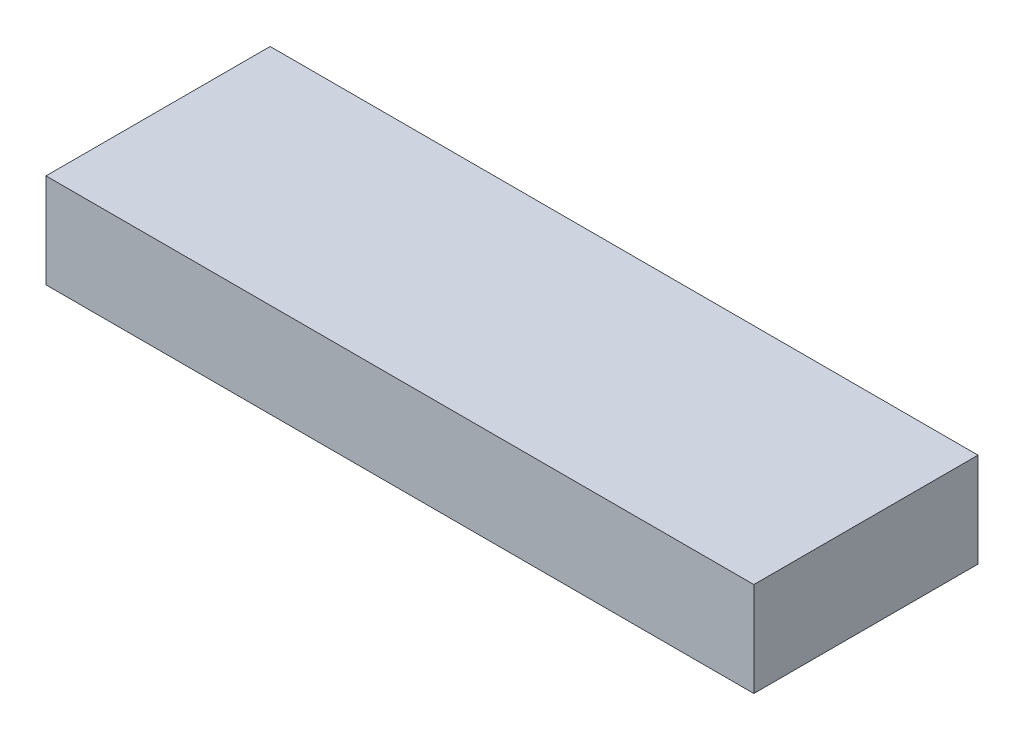
ISO-10303-21;
HEADER;
FILE_DESCRIPTION(('STEP AP214'),'2;1');
FILE_NAME('part.step','',(''),(''),'','','');
FILE_SCHEMA(('AUTOMOTIVE_DESIGN { 1 0 10303 214 1 1 1 1 }'));
ENDSEC;
DATA;
#1=APPLICATION_CONTEXT('core data for automotive mechanical design processes');
#2=APPLICATION_PROTOCOL_DEFINITION('international standard','automotive_design',2000,#1);
#3=PRODUCT_CONTEXT('',#1,'mechanical');
#4=PRODUCT('Part','Part','',(#3));
#5=PRODUCT_RELATED_PRODUCT_CATEGORY('part','',(#4));
#6=PRODUCT_DEFINITION_FORMATION('','',#4);
#7=PRODUCT_DEFINITION_CONTEXT('part definition',#1,'design');
#8=PRODUCT_DEFINITION('design','',#6,#7);
#9=PRODUCT_DEFINITION_SHAPE('','',#8);
#10=(LENGTH_UNIT() NAMED_UNIT(*) SI_UNIT(.MILLI.,.METRE.));
#11=(NAMED_UNIT(*) PLANE_ANGLE_UNIT() SI_UNIT($,.RADIAN.));
#12=(NAMED_UNIT(*) SI_UNIT($,.STERADIAN.) SOLID_ANGLE_UNIT());
#13=UNCERTAINTY_MEASURE_WITH_UNIT(LENGTH_MEASURE(1.E-05),#10,'distance_accuracy_value','');
#14=(GEOMETRIC_REPRESENTATION_CONTEXT(3) GLOBAL_UNCERTAINTY_ASSIGNED_CONTEXT((#13)) GLOBAL_UNIT_ASSIGNED_CONTEXT((#10,
#11,#12)) REPRESENTATION_CONTEXT('',''));
#15=CARTESIAN_POINT('',(0.,0.,0.));
#16=DIRECTION('',(0.,0.,1.));
#17=DIRECTION('',(1.,0.,0.));
#18=AXIS2_PLACEMENT_3D('',#15,#16,#17);
#19=CARTESIAN_POINT('',(30.,8.,-9.49999999999999));
#20=DIRECTION('',(-1.,0.,0.));
#21=DIRECTION('',(0.,0.,1.));
#22=AXIS2_PLACEMENT_3D('',#19,#20,#21);
#23=PLANE('',#22);
#24=DIRECTION('',(0.,0.,-1.));
#25=VECTOR('',#24,1.);
#26=CARTESIAN_POINT('',(30.,0.,-9.49999999999999));
#27=LINE('',#26,#25);
#28=CARTESIAN_POINT('',(30.,0.,9.50000000000001));
#29=VERTEX_POINT('',#28);
#30=CARTESIAN_POINT('',(30.,0.,-9.49999999999999));
#31=VERTEX_POINT('',#30);
#32=EDGE_CURVE('E98',#29,#31,#27,.T.);
#33=ORIENTED_EDGE('',*,*,#32,.T.);
#34=DIRECTION('',(0.,-1.,0.));
#35=VECTOR('',#34,1.);
#36=CARTESIAN_POINT('',(30.,8.,-9.49999999999999));
#37=LINE('',#36,#35);
#38=CARTESIAN_POINT('',(30.,8.,-9.49999999999999));
#39=VERTEX_POINT('',#38);
#40=EDGE_CURVE('E11',#39,#31,#37,.T.);
#41=ORIENTED_EDGE('',*,*,#40,.F.);
#42=DIRECTION('',(0.,0.,-1.));
#43=VECTOR('',#42,1.);
#44=CARTESIAN_POINT('',(30.,8.,-9.49999999999999));
#45=LINE('',#44,#43);
#46=CARTESIAN_POINT('',(30.,8.,9.50000000000001));
#47=VERTEX_POINT('',#46);
#48=EDGE_CURVE('E86',#47,#39,#45,.T.);
#49=ORIENTED_EDGE('',*,*,#48,.F.);
#50=DIRECTION('',(0.,-1.,0.));
#51=VECTOR('',#50,1.);
#52=CARTESIAN_POINT('',(30.,8.,9.50000000000001));
#53=LINE('',#52,#51);
#54=EDGE_CURVE('E94',#47,#29,#53,.T.);
#55=ORIENTED_EDGE('',*,*,#54,.T.);
#56=EDGE_LOOP('',(#33,#41,#49,#55));
#57=FACE_BOUND('',#56,.T.);
#58=ADVANCED_FACE('F35',(#57),#23,.F.);
#59=CARTESIAN_POINT('',(-30.,8.,-9.49999999999999));
#60=DIRECTION('',(0.,0.,1.));
#61=DIRECTION('',(1.,0.,0.));
#62=AXIS2_PLACEMENT_3D('',#59,#60,#61);
#63=PLANE('',#62);
#64=DIRECTION('',(-1.,0.,0.));
#65=VECTOR('',#64,1.);
#66=CARTESIAN_POINT('',(-30.,0.,-9.49999999999999));
#67=LINE('',#66,#65);
#68=CARTESIAN_POINT('',(-30.,0.,-9.49999999999999));
#69=VERTEX_POINT('',#68);
#70=EDGE_CURVE('E90',#31,#69,#67,.T.);
#71=ORIENTED_EDGE('',*,*,#70,.T.);
#72=DIRECTION('',(0.,-1.,0.));
#73=VECTOR('',#72,1.);
#74=CARTESIAN_POINT('',(-30.,8.,-9.49999999999999));
#75=LINE('',#74,#73);
#76=CARTESIAN_POINT('',(-30.,8.,-9.49999999999999));
#77=VERTEX_POINT('',#76);
#78=EDGE_CURVE('E43',#77,#69,#75,.T.);
#79=ORIENTED_EDGE('',*,*,#78,.F.);
#80=DIRECTION('',(-1.,0.,0.));
#81=VECTOR('',#80,1.);
#82=CARTESIAN_POINT('',(-30.,8.,-9.49999999999999));
#83=LINE('',#82,#81);
#84=EDGE_CURVE('E81',#39,#77,#83,.T.);
#85=ORIENTED_EDGE('',*,*,#84,.F.);
#86=ORIENTED_EDGE('',*,*,#40,.T.);
#87=EDGE_LOOP('',(#71,#79,#85,#86));
#88=FACE_BOUND('',#87,.T.);
#89=ADVANCED_FACE('F89',(#88),#63,.F.);
#90=CARTESIAN_POINT('',(-30.,8.,-9.49999999999999));
#91=DIRECTION('',(1.,0.,0.));
#92=DIRECTION('',(0.,0.,-1.));
#93=AXIS2_PLACEMENT_3D('',#90,#91,#92);
#94=PLANE('',#93);
#95=DIRECTION('',(0.,0.,1.));
#96=VECTOR('',#95,1.);
#97=CARTESIAN_POINT('',(-30.,0.,-9.49999999999999));
#98=LINE('',#97,#96);
#99=CARTESIAN_POINT('',(-30.,0.,9.50000000000001));
#100=VERTEX_POINT('',#99);
#101=EDGE_CURVE('E68',#69,#100,#98,.T.);
#102=ORIENTED_EDGE('',*,*,#101,.T.);
#103=DIRECTION('',(0.,-1.,0.));
#104=VECTOR('',#103,1.);
#105=CARTESIAN_POINT('',(-30.,8.,9.50000000000001));
#106=LINE('',#105,#104);
#107=CARTESIAN_POINT('',(-30.,8.,9.50000000000001));
#108=VERTEX_POINT('',#107);
#109=EDGE_CURVE('E91',#108,#100,#106,.T.);
#110=ORIENTED_EDGE('',*,*,#109,.F.);
#111=DIRECTION('',(0.,0.,1.));
#112=VECTOR('',#111,1.);
#113=CARTESIAN_POINT('',(-30.,8.,-9.49999999999999));
#114=LINE('',#113,#112);
#115=EDGE_CURVE('E84',#77,#108,#114,.T.);
#116=ORIENTED_EDGE('',*,*,#115,.F.);
#117=ORIENTED_EDGE('',*,*,#78,.T.);
#118=EDGE_LOOP('',(#102,#110,#116,#117));
#119=FACE_BOUND('',#118,.T.);
#120=ADVANCED_FACE('F92',(#119),#94,.F.);
#121=CARTESIAN_POINT('',(-30.,8.,9.50000000000001));
#122=DIRECTION('',(0.,0.,-1.));
#123=DIRECTION('',(-1.,0.,0.));
#124=AXIS2_PLACEMENT_3D('',#121,#122,#123);
#125=PLANE('',#124);
#126=DIRECTION('',(1.,0.,0.));
#127=VECTOR('',#126,1.);
#128=CARTESIAN_POINT('',(-30.,0.,9.50000000000001));
#129=LINE('',#128,#127);
#130=EDGE_CURVE('E74',#100,#29,#129,.T.);
#131=ORIENTED_EDGE('',*,*,#130,.T.);
#132=ORIENTED_EDGE('',*,*,#54,.F.);
#133=DIRECTION('',(1.,0.,0.));
#134=VECTOR('',#133,1.);
#135=CARTESIAN_POINT('',(-30.,8.,9.50000000000001));
#136=LINE('',#135,#134);
#137=EDGE_CURVE('E51',#108,#47,#136,.T.);
#138=ORIENTED_EDGE('',*,*,#137,.F.);
#139=ORIENTED_EDGE('',*,*,#109,.T.);
#140=EDGE_LOOP('',(#131,#132,#138,#139));
#141=FACE_BOUND('',#140,.T.);
#142=ADVANCED_FACE('F105',(#141),#125,.F.);
#143=CARTESIAN_POINT('',(0.,8.,0.));
#144=DIRECTION('',(0.,1.,0.));
#145=DIRECTION('',(0.,0.,1.));
#146=AXIS2_PLACEMENT_3D('',#143,#144,#145);
#147=PLANE('',#146);
#148=ORIENTED_EDGE('',*,*,#48,.T.);
#149=ORIENTED_EDGE('',*,*,#84,.T.);
#150=ORIENTED_EDGE('',*,*,#115,.T.);
#151=ORIENTED_EDGE('',*,*,#137,.T.);
#152=EDGE_LOOP('',(#148,#149,#150,#151));
#153=FACE_BOUND('',#152,.T.);
#154=ADVANCED_FACE('F82',(#153),#147,.T.);
#155=CARTESIAN_POINT('',(0.,0.,0.));
#156=DIRECTION('',(0.,1.,0.));
#157=DIRECTION('',(0.,0.,1.));
#158=AXIS2_PLACEMENT_3D('',#155,#156,#157);
#159=PLANE('',#158);
#160=ORIENTED_EDGE('',*,*,#32,.F.);
#161=ORIENTED_EDGE('',*,*,#130,.F.);
#162=ORIENTED_EDGE('',*,*,#101,.F.);
#163=ORIENTED_EDGE('',*,*,#70,.F.);
#164=EDGE_LOOP('',(#160,#161,#162,#163));
#165=FACE_BOUND('',#164,.T.);
#166=ADVANCED_FACE('F108',(#165),#159,.F.);
#167=CLOSED_SHELL('',(#58,#89,#120,#142,#154,#166));
#168=MANIFOLD_SOLID_BREP('B2',#167);
#169=ADVANCED_BREP_SHAPE_REPRESENTATION('',(#18,#168),#14);
#170=SHAPE_DEFINITION_REPRESENTATION(#9,#169);
ENDSEC;
END-ISO-10303-21;
